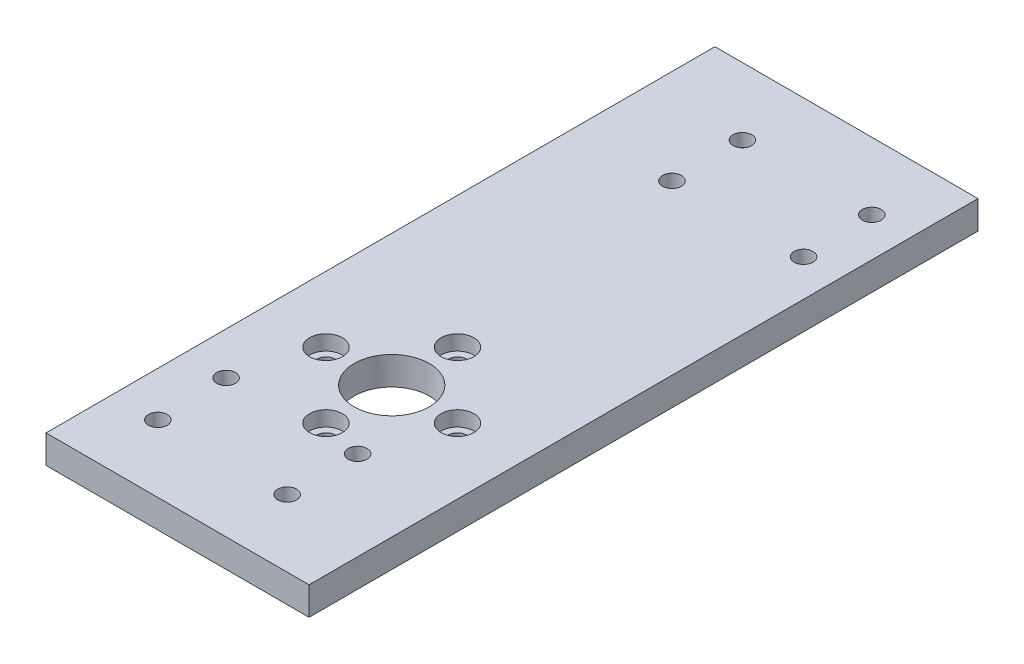
ISO-10303-21;
HEADER;
FILE_DESCRIPTION(('STEP AP214'),'2;1');
FILE_NAME('part.step','',(''),(''),'','','');
FILE_SCHEMA(('AUTOMOTIVE_DESIGN { 1 0 10303 214 1 1 1 1 }'));
ENDSEC;
DATA;
#1=APPLICATION_CONTEXT('core data for automotive mechanical design processes');
#2=APPLICATION_PROTOCOL_DEFINITION('international standard','automotive_design',2000,#1);
#3=PRODUCT_CONTEXT('',#1,'mechanical');
#4=PRODUCT('Part','Part','',(#3));
#5=PRODUCT_RELATED_PRODUCT_CATEGORY('part','',(#4));
#6=PRODUCT_DEFINITION_FORMATION('','',#4);
#7=PRODUCT_DEFINITION_CONTEXT('part definition',#1,'design');
#8=PRODUCT_DEFINITION('design','',#6,#7);
#9=PRODUCT_DEFINITION_SHAPE('','',#8);
#10=(LENGTH_UNIT() NAMED_UNIT(*) SI_UNIT(.MILLI.,.METRE.));
#11=(NAMED_UNIT(*) PLANE_ANGLE_UNIT() SI_UNIT($,.RADIAN.));
#12=(NAMED_UNIT(*) SI_UNIT($,.STERADIAN.) SOLID_ANGLE_UNIT());
#13=UNCERTAINTY_MEASURE_WITH_UNIT(LENGTH_MEASURE(1.E-05),#10,'distance_accuracy_value','');
#14=(GEOMETRIC_REPRESENTATION_CONTEXT(3) GLOBAL_UNCERTAINTY_ASSIGNED_CONTEXT((#13)) GLOBAL_UNIT_ASSIGNED_CONTEXT((#10,
#11,#12)) REPRESENTATION_CONTEXT('',''));
#15=CARTESIAN_POINT('',(0.,0.,0.));
#16=DIRECTION('',(0.,0.,1.));
#17=DIRECTION('',(1.,0.,0.));
#18=AXIS2_PLACEMENT_3D('',#15,#16,#17);
#19=CARTESIAN_POINT('',(-3.91877513505073,-7.,-28.4481628818932));
#20=DIRECTION('',(0.,1.,0.));
#21=DIRECTION('',(0.,0.,1.));
#22=AXIS2_PLACEMENT_3D('',#19,#20,#21);
#23=CYLINDRICAL_SURFACE('',#22,1.00000000000001);
#24=CARTESIAN_POINT('',(-3.91877513505073,3.,-28.4481628818932));
#25=DIRECTION('',(0.,1.,0.));
#26=DIRECTION('',(0.,0.,1.));
#27=AXIS2_PLACEMENT_3D('',#24,#25,#26);
#28=CIRCLE('',#27,1.00000000000001);
#29=CARTESIAN_POINT('',(-3.91877513505073,3.,-27.4481628818932));
#30=VERTEX_POINT('',#29);
#31=EDGE_CURVE('E242',#30,#30,#28,.T.);
#32=ORIENTED_EDGE('',*,*,#31,.T.);
#33=EDGE_LOOP('',(#32));
#34=FACE_BOUND('',#33,.T.);
#35=CARTESIAN_POINT('',(-3.91877513505073,1.6,-28.4481628818932));
#36=DIRECTION('',(0.,-1.,0.));
#37=DIRECTION('',(0.,0.,-1.));
#38=AXIS2_PLACEMENT_3D('',#35,#36,#37);
#39=CIRCLE('',#38,1.00000000000001);
#40=CARTESIAN_POINT('',(-3.91877513505073,1.6,-29.4481628818932));
#41=VERTEX_POINT('',#40);
#42=EDGE_CURVE('E41',#41,#41,#39,.F.);
#43=ORIENTED_EDGE('',*,*,#42,.F.);
#44=EDGE_LOOP('',(#43));
#45=FACE_BOUND('',#44,.T.);
#46=ADVANCED_FACE('F37',(#34,#45),#23,.F.);
#47=CARTESIAN_POINT('',(4.51877513505392,-7.,20.9481628818913));
#48=DIRECTION('',(0.,1.,0.));
#49=DIRECTION('',(0.,0.,1.));
#50=AXIS2_PLACEMENT_3D('',#47,#48,#49);
#51=CYLINDRICAL_SURFACE('',#50,1.00000000000002);
#52=CARTESIAN_POINT('',(4.51877513505392,3.,20.9481628818913));
#53=DIRECTION('',(0.,1.,0.));
#54=DIRECTION('',(0.,0.,1.));
#55=AXIS2_PLACEMENT_3D('',#52,#53,#54);
#56=CIRCLE('',#55,1.00000000000002);
#57=CARTESIAN_POINT('',(4.51877513505392,3.,21.9481628818913));
#58=VERTEX_POINT('',#57);
#59=EDGE_CURVE('E245',#58,#58,#56,.T.);
#60=ORIENTED_EDGE('',*,*,#59,.T.);
#61=EDGE_LOOP('',(#60));
#62=FACE_BOUND('',#61,.T.);
#63=CARTESIAN_POINT('',(4.51877513505392,1.6,20.9481628818913));
#64=DIRECTION('',(0.,-1.,0.));
#65=DIRECTION('',(0.,0.,-1.));
#66=AXIS2_PLACEMENT_3D('',#63,#64,#65);
#67=CIRCLE('',#66,1.00000000000002);
#68=CARTESIAN_POINT('',(4.51877513505392,1.6,19.9481628818913));
#69=VERTEX_POINT('',#68);
#70=EDGE_CURVE('E177',#69,#69,#67,.F.);
#71=ORIENTED_EDGE('',*,*,#70,.F.);
#72=EDGE_LOOP('',(#71));
#73=FACE_BOUND('',#72,.T.);
#74=ADVANCED_FACE('F278',(#62,#73),#51,.F.);
#75=CARTESIAN_POINT('',(4.51877513505393,-7.,28.4481628818913));
#76=DIRECTION('',(0.,1.,0.));
#77=DIRECTION('',(0.,0.,1.));
#78=AXIS2_PLACEMENT_3D('',#75,#76,#77);
#79=CYLINDRICAL_SURFACE('',#78,1.00000000000002);
#80=CARTESIAN_POINT('',(4.51877513505393,3.,28.4481628818913));
#81=DIRECTION('',(0.,1.,0.));
#82=DIRECTION('',(0.,0.,1.));
#83=AXIS2_PLACEMENT_3D('',#80,#81,#82);
#84=CIRCLE('',#83,1.00000000000002);
#85=CARTESIAN_POINT('',(4.51877513505393,3.,29.4481628818913));
#86=VERTEX_POINT('',#85);
#87=EDGE_CURVE('E248',#86,#86,#84,.T.);
#88=ORIENTED_EDGE('',*,*,#87,.T.);
#89=EDGE_LOOP('',(#88));
#90=FACE_BOUND('',#89,.T.);
#91=CARTESIAN_POINT('',(4.51877513505393,1.6,28.4481628818913));
#92=DIRECTION('',(0.,-1.,0.));
#93=DIRECTION('',(0.,0.,-1.));
#94=AXIS2_PLACEMENT_3D('',#91,#92,#93);
#95=CIRCLE('',#94,1.00000000000002);
#96=CARTESIAN_POINT('',(4.51877513505393,1.6,27.4481628818913));
#97=VERTEX_POINT('',#96);
#98=EDGE_CURVE('E173',#97,#97,#95,.F.);
#99=ORIENTED_EDGE('',*,*,#98,.F.);
#100=EDGE_LOOP('',(#99));
#101=FACE_BOUND('',#100,.T.);
#102=ADVANCED_FACE('F284',(#90,#101),#79,.F.);
#103=CARTESIAN_POINT('',(-9.48122486494609,-7.,20.9481628818913));
#104=DIRECTION('',(0.,1.,0.));
#105=DIRECTION('',(0.,0.,1.));
#106=AXIS2_PLACEMENT_3D('',#103,#104,#105);
#107=CYLINDRICAL_SURFACE('',#106,1.00000000000001);
#108=CARTESIAN_POINT('',(-9.48122486494609,3.,20.9481628818913));
#109=DIRECTION('',(0.,1.,0.));
#110=DIRECTION('',(0.,0.,1.));
#111=AXIS2_PLACEMENT_3D('',#108,#109,#110);
#112=CIRCLE('',#111,1.00000000000001);
#113=CARTESIAN_POINT('',(-9.48122486494609,3.,21.9481628818913));
#114=VERTEX_POINT('',#113);
#115=EDGE_CURVE('E254',#114,#114,#112,.T.);
#116=ORIENTED_EDGE('',*,*,#115,.T.);
#117=EDGE_LOOP('',(#116));
#118=FACE_BOUND('',#117,.T.);
#119=CARTESIAN_POINT('',(-9.48122486494609,1.6,20.9481628818913));
#120=DIRECTION('',(0.,-1.,0.));
#121=DIRECTION('',(0.,0.,-1.));
#122=AXIS2_PLACEMENT_3D('',#119,#120,#121);
#123=CIRCLE('',#122,1.00000000000001);
#124=CARTESIAN_POINT('',(-9.48122486494609,1.6,19.9481628818913));
#125=VERTEX_POINT('',#124);
#126=EDGE_CURVE('E168',#125,#125,#123,.F.);
#127=ORIENTED_EDGE('',*,*,#126,.F.);
#128=EDGE_LOOP('',(#127));
#129=FACE_BOUND('',#128,.T.);
#130=ADVANCED_FACE('F294',(#118,#129),#107,.F.);
#131=CARTESIAN_POINT('',(-9.24883244467996,-7.,28.4481628818913));
#132=DIRECTION('',(0.,1.,0.));
#133=DIRECTION('',(0.,0.,1.));
#134=AXIS2_PLACEMENT_3D('',#131,#132,#133);
#135=CYLINDRICAL_SURFACE('',#134,1.00000000000001);
#136=CARTESIAN_POINT('',(-9.24883244467996,3.,28.4481628818913));
#137=DIRECTION('',(0.,1.,0.));
#138=DIRECTION('',(0.,0.,1.));
#139=AXIS2_PLACEMENT_3D('',#136,#137,#138);
#140=CIRCLE('',#139,1.00000000000001);
#141=CARTESIAN_POINT('',(-9.24883244467996,3.,29.4481628818913));
#142=VERTEX_POINT('',#141);
#143=EDGE_CURVE('E251',#142,#142,#140,.T.);
#144=ORIENTED_EDGE('',*,*,#143,.T.);
#145=EDGE_LOOP('',(#144));
#146=FACE_BOUND('',#145,.T.);
#147=CARTESIAN_POINT('',(-9.24883244467996,1.6,28.4481628818913));
#148=DIRECTION('',(0.,-1.,0.));
#149=DIRECTION('',(0.,0.,-1.));
#150=AXIS2_PLACEMENT_3D('',#147,#148,#149);
#151=CIRCLE('',#150,1.00000000000001);
#152=CARTESIAN_POINT('',(-9.24883244467996,1.6,27.4481628818913));
#153=VERTEX_POINT('',#152);
#154=EDGE_CURVE('E163',#153,#153,#151,.F.);
#155=ORIENTED_EDGE('',*,*,#154,.F.);
#156=EDGE_LOOP('',(#155));
#157=FACE_BOUND('',#156,.T.);
#158=ADVANCED_FACE('F296',(#146,#157),#135,.F.);
#159=CARTESIAN_POINT('',(10.0812248649493,-7.,-20.9481628818932));
#160=DIRECTION('',(0.,1.,0.));
#161=DIRECTION('',(0.,0.,1.));
#162=AXIS2_PLACEMENT_3D('',#159,#160,#161);
#163=CYLINDRICAL_SURFACE('',#162,1.);
#164=CARTESIAN_POINT('',(10.0812248649493,3.,-20.9481628818932));
#165=DIRECTION('',(0.,1.,0.));
#166=DIRECTION('',(0.,0.,1.));
#167=AXIS2_PLACEMENT_3D('',#164,#165,#166);
#168=CIRCLE('',#167,1.);
#169=CARTESIAN_POINT('',(10.0812248649493,3.,-19.9481628818932));
#170=VERTEX_POINT('',#169);
#171=EDGE_CURVE('E236',#170,#170,#168,.T.);
#172=ORIENTED_EDGE('',*,*,#171,.T.);
#173=EDGE_LOOP('',(#172));
#174=FACE_BOUND('',#173,.T.);
#175=CARTESIAN_POINT('',(10.0812248649493,1.6,-20.9481628818932));
#176=DIRECTION('',(0.,-1.,0.));
#177=DIRECTION('',(0.,0.,-1.));
#178=AXIS2_PLACEMENT_3D('',#175,#176,#177);
#179=CIRCLE('',#178,1.);
#180=CARTESIAN_POINT('',(10.0812248649493,1.6,-21.9481628818932));
#181=VERTEX_POINT('',#180);
#182=EDGE_CURVE('E158',#181,#181,#179,.F.);
#183=ORIENTED_EDGE('',*,*,#182,.F.);
#184=EDGE_LOOP('',(#183));
#185=FACE_BOUND('',#184,.T.);
#186=ADVANCED_FACE('F299',(#174,#185),#163,.F.);
#187=CARTESIAN_POINT('',(9.84883244468316,-7.,-28.4481628818932));
#188=DIRECTION('',(0.,1.,0.));
#189=DIRECTION('',(0.,0.,1.));
#190=AXIS2_PLACEMENT_3D('',#187,#188,#189);
#191=CYLINDRICAL_SURFACE('',#190,1.00000000000001);
#192=CARTESIAN_POINT('',(9.84883244468316,3.,-28.4481628818932));
#193=DIRECTION('',(0.,1.,0.));
#194=DIRECTION('',(0.,0.,1.));
#195=AXIS2_PLACEMENT_3D('',#192,#193,#194);
#196=CIRCLE('',#195,1.00000000000001);
#197=CARTESIAN_POINT('',(9.84883244468316,3.,-27.4481628818932));
#198=VERTEX_POINT('',#197);
#199=EDGE_CURVE('E239',#198,#198,#196,.T.);
#200=ORIENTED_EDGE('',*,*,#199,.T.);
#201=EDGE_LOOP('',(#200));
#202=FACE_BOUND('',#201,.T.);
#203=CARTESIAN_POINT('',(9.84883244468316,1.6,-28.4481628818932));
#204=DIRECTION('',(0.,-1.,0.));
#205=DIRECTION('',(0.,0.,-1.));
#206=AXIS2_PLACEMENT_3D('',#203,#204,#205);
#207=CIRCLE('',#206,1.00000000000001);
#208=CARTESIAN_POINT('',(9.84883244468316,1.6,-29.4481628818932));
#209=VERTEX_POINT('',#208);
#210=EDGE_CURVE('E153',#209,#209,#207,.F.);
#211=ORIENTED_EDGE('',*,*,#210,.F.);
#212=EDGE_LOOP('',(#211));
#213=FACE_BOUND('',#212,.T.);
#214=ADVANCED_FACE('F289',(#202,#213),#191,.F.);
#215=CARTESIAN_POINT('',(-3.91877513505072,-7.,-20.9481628818932));
#216=DIRECTION('',(0.,1.,0.));
#217=DIRECTION('',(0.,0.,1.));
#218=AXIS2_PLACEMENT_3D('',#215,#216,#217);
#219=CYLINDRICAL_SURFACE('',#218,1.00000000000001);
#220=CARTESIAN_POINT('',(-3.91877513505072,3.,-20.9481628818932));
#221=DIRECTION('',(0.,1.,0.));
#222=DIRECTION('',(0.,0.,1.));
#223=AXIS2_PLACEMENT_3D('',#220,#221,#222);
#224=CIRCLE('',#223,1.00000000000001);
#225=CARTESIAN_POINT('',(-3.91877513505072,3.,-19.9481628818932));
#226=VERTEX_POINT('',#225);
#227=EDGE_CURVE('E131',#226,#226,#224,.T.);
#228=ORIENTED_EDGE('',*,*,#227,.T.);
#229=EDGE_LOOP('',(#228));
#230=FACE_BOUND('',#229,.T.);
#231=CARTESIAN_POINT('',(-3.91877513505072,1.6,-20.9481628818932));
#232=DIRECTION('',(0.,-1.,0.));
#233=DIRECTION('',(0.,0.,-1.));
#234=AXIS2_PLACEMENT_3D('',#231,#232,#233);
#235=CIRCLE('',#234,1.00000000000001);
#236=CARTESIAN_POINT('',(-3.91877513505072,1.6,-21.9481628818932));
#237=VERTEX_POINT('',#236);
#238=EDGE_CURVE('E148',#237,#237,#235,.F.);
#239=ORIENTED_EDGE('',*,*,#238,.F.);
#240=EDGE_LOOP('',(#239));
#241=FACE_BOUND('',#240,.T.);
#242=ADVANCED_FACE('F319',(#230,#241),#219,.F.);
#243=CARTESIAN_POINT('',(7.0000000000001,-7.,12.7999999999978));
#244=DIRECTION('',(0.,1.,0.));
#245=DIRECTION('',(0.,0.,1.));
#246=AXIS2_PLACEMENT_3D('',#243,#244,#245);
#247=CYLINDRICAL_SURFACE('',#246,1.);
#248=CARTESIAN_POINT('',(7.0000000000001,0.,12.7999999999978));
#249=DIRECTION('',(0.,-1.,0.));
#250=DIRECTION('',(0.,0.,-1.));
#251=AXIS2_PLACEMENT_3D('',#248,#249,#250);
#252=CIRCLE('',#251,1.);
#253=CARTESIAN_POINT('',(7.0000000000001,0.,11.7999999999978));
#254=VERTEX_POINT('',#253);
#255=EDGE_CURVE('E115',#254,#254,#252,.T.);
#256=ORIENTED_EDGE('',*,*,#255,.T.);
#257=EDGE_LOOP('',(#256));
#258=FACE_BOUND('',#257,.T.);
#259=CARTESIAN_POINT('',(7.0000000000001,1.4,12.7999999999978));
#260=DIRECTION('',(0.,1.,0.));
#261=DIRECTION('',(0.,0.,1.));
#262=AXIS2_PLACEMENT_3D('',#259,#260,#261);
#263=CIRCLE('',#262,1.);
#264=CARTESIAN_POINT('',(7.0000000000001,1.4,13.7999999999978));
#265=VERTEX_POINT('',#264);
#266=EDGE_CURVE('E143',#265,#265,#263,.F.);
#267=ORIENTED_EDGE('',*,*,#266,.F.);
#268=EDGE_LOOP('',(#267));
#269=FACE_BOUND('',#268,.T.);
#270=ADVANCED_FACE('F312',(#258,#269),#247,.F.);
#271=CARTESIAN_POINT('',(-6.9999999999999,-7.,12.7999999999979));
#272=DIRECTION('',(0.,1.,0.));
#273=DIRECTION('',(0.,0.,1.));
#274=AXIS2_PLACEMENT_3D('',#271,#272,#273);
#275=CYLINDRICAL_SURFACE('',#274,1.);
#276=CARTESIAN_POINT('',(-6.9999999999999,0.,12.7999999999979));
#277=DIRECTION('',(0.,-1.,0.));
#278=DIRECTION('',(0.,0.,-1.));
#279=AXIS2_PLACEMENT_3D('',#276,#277,#278);
#280=CIRCLE('',#279,1.);
#281=CARTESIAN_POINT('',(-6.9999999999999,0.,11.7999999999979));
#282=VERTEX_POINT('',#281);
#283=EDGE_CURVE('E121',#282,#282,#280,.T.);
#284=ORIENTED_EDGE('',*,*,#283,.T.);
#285=EDGE_LOOP('',(#284));
#286=FACE_BOUND('',#285,.T.);
#287=CARTESIAN_POINT('',(-6.9999999999999,1.4,12.7999999999979));
#288=DIRECTION('',(0.,1.,0.));
#289=DIRECTION('',(0.,0.,1.));
#290=AXIS2_PLACEMENT_3D('',#287,#288,#289);
#291=CIRCLE('',#290,1.);
#292=CARTESIAN_POINT('',(-6.9999999999999,1.4,13.7999999999979));
#293=VERTEX_POINT('',#292);
#294=EDGE_CURVE('E138',#293,#293,#291,.F.);
#295=ORIENTED_EDGE('',*,*,#294,.F.);
#296=EDGE_LOOP('',(#295));
#297=FACE_BOUND('',#296,.T.);
#298=ADVANCED_FACE('F308',(#286,#297),#275,.F.);
#299=CARTESIAN_POINT('',(0.,-7.,5.79999999999792));
#300=DIRECTION('',(0.,1.,0.));
#301=DIRECTION('',(0.,0.,1.));
#302=AXIS2_PLACEMENT_3D('',#299,#300,#301);
#303=CYLINDRICAL_SURFACE('',#302,1.);
#304=CARTESIAN_POINT('',(0.,0.,5.79999999999792));
#305=DIRECTION('',(0.,-1.,0.));
#306=DIRECTION('',(0.,0.,-1.));
#307=AXIS2_PLACEMENT_3D('',#304,#305,#306);
#308=CIRCLE('',#307,1.);
#309=CARTESIAN_POINT('',(0.,0.,4.79999999999792));
#310=VERTEX_POINT('',#309);
#311=EDGE_CURVE('E107',#310,#310,#308,.T.);
#312=ORIENTED_EDGE('',*,*,#311,.T.);
#313=EDGE_LOOP('',(#312));
#314=FACE_BOUND('',#313,.T.);
#315=CARTESIAN_POINT('',(0.,1.4,5.79999999999792));
#316=DIRECTION('',(0.,1.,0.));
#317=DIRECTION('',(0.,0.,1.));
#318=AXIS2_PLACEMENT_3D('',#315,#316,#317);
#319=CIRCLE('',#318,1.);
#320=CARTESIAN_POINT('',(0.,1.4,6.79999999999792));
#321=VERTEX_POINT('',#320);
#322=EDGE_CURVE('E133',#321,#321,#319,.F.);
#323=ORIENTED_EDGE('',*,*,#322,.F.);
#324=EDGE_LOOP('',(#323));
#325=FACE_BOUND('',#324,.T.);
#326=ADVANCED_FACE('F311',(#314,#325),#303,.F.);
#327=CARTESIAN_POINT('',(1.45764745514838E-13,-7.,19.7999999999979));
#328=DIRECTION('',(0.,1.,0.));
#329=DIRECTION('',(0.,0.,1.));
#330=AXIS2_PLACEMENT_3D('',#327,#328,#329);
#331=CYLINDRICAL_SURFACE('',#330,1.);
#332=CARTESIAN_POINT('',(1.45764745514838E-13,0.,19.7999999999979));
#333=DIRECTION('',(0.,-1.,0.));
#334=DIRECTION('',(0.,0.,-1.));
#335=AXIS2_PLACEMENT_3D('',#332,#333,#334);
#336=CIRCLE('',#335,1.);
#337=CARTESIAN_POINT('',(1.45764745514838E-13,0.,18.7999999999979));
#338=VERTEX_POINT('',#337);
#339=EDGE_CURVE('E118',#338,#338,#336,.T.);
#340=ORIENTED_EDGE('',*,*,#339,.T.);
#341=EDGE_LOOP('',(#340));
#342=FACE_BOUND('',#341,.T.);
#343=CARTESIAN_POINT('',(1.45764745514838E-13,1.4,19.7999999999979));
#344=DIRECTION('',(0.,1.,0.));
#345=DIRECTION('',(0.,0.,1.));
#346=AXIS2_PLACEMENT_3D('',#343,#344,#345);
#347=CIRCLE('',#346,1.);
#348=CARTESIAN_POINT('',(1.45764745514838E-13,1.4,20.7999999999979));
#349=VERTEX_POINT('',#348);
#350=EDGE_CURVE('E128',#349,#349,#347,.F.);
#351=ORIENTED_EDGE('',*,*,#350,.F.);
#352=EDGE_LOOP('',(#351));
#353=FACE_BOUND('',#352,.T.);
#354=ADVANCED_FACE('F314',(#342,#353),#331,.F.);
#355=CARTESIAN_POINT('',(14.,3.,35.6));
#356=DIRECTION('',(-1.,0.,0.));
#357=DIRECTION('',(0.,0.,1.));
#358=AXIS2_PLACEMENT_3D('',#355,#356,#357);
#359=PLANE('',#358);
#360=DIRECTION('',(0.,0.,-1.));
#361=VECTOR('',#360,1.);
#362=CARTESIAN_POINT('',(14.,0.,35.6));
#363=LINE('',#362,#361);
#364=CARTESIAN_POINT('',(14.,0.,35.6));
#365=VERTEX_POINT('',#364);
#366=CARTESIAN_POINT('',(14.,0.,-35.6));
#367=VERTEX_POINT('',#366);
#368=EDGE_CURVE('E104',#365,#367,#363,.T.);
#369=ORIENTED_EDGE('',*,*,#368,.T.);
#370=DIRECTION('',(0.,-1.,0.));
#371=VECTOR('',#370,1.);
#372=CARTESIAN_POINT('',(14.,3.,-35.6));
#373=LINE('',#372,#371);
#374=CARTESIAN_POINT('',(14.,3.,-35.6));
#375=VERTEX_POINT('',#374);
#376=EDGE_CURVE('E11',#375,#367,#373,.T.);
#377=ORIENTED_EDGE('',*,*,#376,.F.);
#378=DIRECTION('',(0.,0.,-1.));
#379=VECTOR('',#378,1.);
#380=CARTESIAN_POINT('',(14.,3.,35.6));
#381=LINE('',#380,#379);
#382=CARTESIAN_POINT('',(14.,3.,35.6));
#383=VERTEX_POINT('',#382);
#384=EDGE_CURVE('E91',#383,#375,#381,.T.);
#385=ORIENTED_EDGE('',*,*,#384,.F.);
#386=DIRECTION('',(0.,-1.,0.));
#387=VECTOR('',#386,1.);
#388=CARTESIAN_POINT('',(14.,3.,35.6));
#389=LINE('',#388,#387);
#390=EDGE_CURVE('E100',#383,#365,#389,.T.);
#391=ORIENTED_EDGE('',*,*,#390,.T.);
#392=EDGE_LOOP('',(#369,#377,#385,#391));
#393=FACE_BOUND('',#392,.T.);
#394=ADVANCED_FACE('F39',(#393),#359,.F.);
#395=CARTESIAN_POINT('',(-14.,3.,-35.6));
#396=DIRECTION('',(0.,0.,1.));
#397=DIRECTION('',(1.,0.,0.));
#398=AXIS2_PLACEMENT_3D('',#395,#396,#397);
#399=PLANE('',#398);
#400=DIRECTION('',(-1.,0.,0.));
#401=VECTOR('',#400,1.);
#402=CARTESIAN_POINT('',(-14.,0.,-35.6));
#403=LINE('',#402,#401);
#404=CARTESIAN_POINT('',(-14.,0.,-35.6));
#405=VERTEX_POINT('',#404);
#406=EDGE_CURVE('E95',#367,#405,#403,.T.);
#407=ORIENTED_EDGE('',*,*,#406,.T.);
#408=DIRECTION('',(0.,-1.,0.));
#409=VECTOR('',#408,1.);
#410=CARTESIAN_POINT('',(-14.,3.,-35.6));
#411=LINE('',#410,#409);
#412=CARTESIAN_POINT('',(-14.,3.,-35.6));
#413=VERTEX_POINT('',#412);
#414=EDGE_CURVE('E47',#413,#405,#411,.T.);
#415=ORIENTED_EDGE('',*,*,#414,.F.);
#416=DIRECTION('',(-1.,0.,0.));
#417=VECTOR('',#416,1.);
#418=CARTESIAN_POINT('',(-14.,3.,-35.6));
#419=LINE('',#418,#417);
#420=EDGE_CURVE('E86',#375,#413,#419,.T.);
#421=ORIENTED_EDGE('',*,*,#420,.F.);
#422=ORIENTED_EDGE('',*,*,#376,.T.);
#423=EDGE_LOOP('',(#407,#415,#421,#422));
#424=FACE_BOUND('',#423,.T.);
#425=ADVANCED_FACE('F94',(#424),#399,.F.);
#426=CARTESIAN_POINT('',(-14.,3.,35.6));
#427=DIRECTION('',(1.,0.,0.));
#428=DIRECTION('',(0.,0.,-1.));
#429=AXIS2_PLACEMENT_3D('',#426,#427,#428);
#430=PLANE('',#429);
#431=DIRECTION('',(0.,0.,1.));
#432=VECTOR('',#431,1.);
#433=CARTESIAN_POINT('',(-14.,0.,35.6));
#434=LINE('',#433,#432);
#435=CARTESIAN_POINT('',(-14.,0.,35.6));
#436=VERTEX_POINT('',#435);
#437=EDGE_CURVE('E73',#405,#436,#434,.T.);
#438=ORIENTED_EDGE('',*,*,#437,.T.);
#439=DIRECTION('',(0.,-1.,0.));
#440=VECTOR('',#439,1.);
#441=CARTESIAN_POINT('',(-14.,3.,35.6));
#442=LINE('',#441,#440);
#443=CARTESIAN_POINT('',(-14.,3.,35.6));
#444=VERTEX_POINT('',#443);
#445=EDGE_CURVE('E96',#444,#436,#442,.T.);
#446=ORIENTED_EDGE('',*,*,#445,.F.);
#447=DIRECTION('',(0.,0.,1.));
#448=VECTOR('',#447,1.);
#449=CARTESIAN_POINT('',(-14.,3.,35.6));
#450=LINE('',#449,#448);
#451=EDGE_CURVE('E89',#413,#444,#450,.T.);
#452=ORIENTED_EDGE('',*,*,#451,.F.);
#453=ORIENTED_EDGE('',*,*,#414,.T.);
#454=EDGE_LOOP('',(#438,#446,#452,#453));
#455=FACE_BOUND('',#454,.T.);
#456=ADVANCED_FACE('F98',(#455),#430,.F.);
#457=CARTESIAN_POINT('',(-14.,3.,35.6));
#458=DIRECTION('',(0.,0.,-1.));
#459=DIRECTION('',(-1.,0.,0.));
#460=AXIS2_PLACEMENT_3D('',#457,#458,#459);
#461=PLANE('',#460);
#462=DIRECTION('',(1.,0.,0.));
#463=VECTOR('',#462,1.);
#464=CARTESIAN_POINT('',(-14.,0.,35.6));
#465=LINE('',#464,#463);
#466=EDGE_CURVE('E79',#436,#365,#465,.T.);
#467=ORIENTED_EDGE('',*,*,#466,.T.);
#468=ORIENTED_EDGE('',*,*,#390,.F.);
#469=DIRECTION('',(1.,0.,0.));
#470=VECTOR('',#469,1.);
#471=CARTESIAN_POINT('',(-14.,3.,35.6));
#472=LINE('',#471,#470);
#473=EDGE_CURVE('E56',#444,#383,#472,.T.);
#474=ORIENTED_EDGE('',*,*,#473,.F.);
#475=ORIENTED_EDGE('',*,*,#445,.T.);
#476=EDGE_LOOP('',(#467,#468,#474,#475));
#477=FACE_BOUND('',#476,.T.);
#478=ADVANCED_FACE('F264',(#477),#461,.F.);
#479=CARTESIAN_POINT('',(0.,3.,0.));
#480=DIRECTION('',(0.,-1.,0.));
#481=DIRECTION('',(0.,0.,-1.));
#482=AXIS2_PLACEMENT_3D('',#479,#480,#481);
#483=PLANE('',#482);
#484=CARTESIAN_POINT('',(7.0000000000001,3.,12.7999999999978));
#485=DIRECTION('',(0.,1.,0.));
#486=DIRECTION('',(0.,0.,1.));
#487=AXIS2_PLACEMENT_3D('',#484,#485,#486);
#488=CIRCLE('',#487,1.75);
#489=CARTESIAN_POINT('',(7.0000000000001,3.,14.5499999999978));
#490=VERTEX_POINT('',#489);
#491=EDGE_CURVE('E151',#490,#490,#488,.T.);
#492=ORIENTED_EDGE('',*,*,#491,.F.);
#493=EDGE_LOOP('',(#492));
#494=FACE_BOUND('',#493,.T.);
#495=CARTESIAN_POINT('',(-6.9999999999999,3.,12.7999999999979));
#496=DIRECTION('',(0.,1.,0.));
#497=DIRECTION('',(0.,0.,1.));
#498=AXIS2_PLACEMENT_3D('',#495,#496,#497);
#499=CIRCLE('',#498,1.75);
#500=CARTESIAN_POINT('',(-6.9999999999999,3.,14.5499999999979));
#501=VERTEX_POINT('',#500);
#502=EDGE_CURVE('E146',#501,#501,#499,.T.);
#503=ORIENTED_EDGE('',*,*,#502,.F.);
#504=EDGE_LOOP('',(#503));
#505=FACE_BOUND('',#504,.T.);
#506=CARTESIAN_POINT('',(0.,3.,5.79999999999792));
#507=DIRECTION('',(0.,1.,0.));
#508=DIRECTION('',(0.,0.,1.));
#509=AXIS2_PLACEMENT_3D('',#506,#507,#508);
#510=CIRCLE('',#509,1.75);
#511=CARTESIAN_POINT('',(0.,3.,7.54999999999792));
#512=VERTEX_POINT('',#511);
#513=EDGE_CURVE('E141',#512,#512,#510,.T.);
#514=ORIENTED_EDGE('',*,*,#513,.F.);
#515=EDGE_LOOP('',(#514));
#516=FACE_BOUND('',#515,.T.);
#517=CARTESIAN_POINT('',(1.45764745514838E-13,3.,19.7999999999979));
#518=DIRECTION('',(0.,1.,0.));
#519=DIRECTION('',(0.,0.,1.));
#520=AXIS2_PLACEMENT_3D('',#517,#518,#519);
#521=CIRCLE('',#520,1.75);
#522=CARTESIAN_POINT('',(1.45764745514838E-13,3.,21.5499999999979));
#523=VERTEX_POINT('',#522);
#524=EDGE_CURVE('E136',#523,#523,#521,.T.);
#525=ORIENTED_EDGE('',*,*,#524,.F.);
#526=EDGE_LOOP('',(#525));
#527=FACE_BOUND('',#526,.T.);
#528=ORIENTED_EDGE('',*,*,#227,.F.);
#529=EDGE_LOOP('',(#528));
#530=FACE_BOUND('',#529,.T.);
#531=ORIENTED_EDGE('',*,*,#171,.F.);
#532=EDGE_LOOP('',(#531));
#533=FACE_BOUND('',#532,.T.);
#534=ORIENTED_EDGE('',*,*,#199,.F.);
#535=EDGE_LOOP('',(#534));
#536=FACE_BOUND('',#535,.T.);
#537=ORIENTED_EDGE('',*,*,#31,.F.);
#538=EDGE_LOOP('',(#537));
#539=FACE_BOUND('',#538,.T.);
#540=ORIENTED_EDGE('',*,*,#59,.F.);
#541=EDGE_LOOP('',(#540));
#542=FACE_BOUND('',#541,.T.);
#543=ORIENTED_EDGE('',*,*,#87,.F.);
#544=EDGE_LOOP('',(#543));
#545=FACE_BOUND('',#544,.T.);
#546=ORIENTED_EDGE('',*,*,#143,.F.);
#547=EDGE_LOOP('',(#546));
#548=FACE_BOUND('',#547,.T.);
#549=ORIENTED_EDGE('',*,*,#115,.F.);
#550=EDGE_LOOP('',(#549));
#551=FACE_BOUND('',#550,.T.);
#552=CARTESIAN_POINT('',(0.,3.,12.7999999999985));
#553=DIRECTION('',(0.,1.,0.));
#554=DIRECTION('',(0.,0.,1.));
#555=AXIS2_PLACEMENT_3D('',#552,#553,#554);
#556=CIRCLE('',#555,4.);
#557=CARTESIAN_POINT('',(0.,3.,16.7999999999985));
#558=VERTEX_POINT('',#557);
#559=EDGE_CURVE('E127',#558,#558,#556,.T.);
#560=ORIENTED_EDGE('',*,*,#559,.F.);
#561=EDGE_LOOP('',(#560));
#562=FACE_BOUND('',#561,.T.);
#563=ORIENTED_EDGE('',*,*,#384,.T.);
#564=ORIENTED_EDGE('',*,*,#420,.T.);
#565=ORIENTED_EDGE('',*,*,#451,.T.);
#566=ORIENTED_EDGE('',*,*,#473,.T.);
#567=EDGE_LOOP('',(#563,#564,#565,#566));
#568=FACE_BOUND('',#567,.T.);
#569=ADVANCED_FACE('F87',(#494,#505,#516,#527,#530,#533,#536,#539,#542,#545,#548,#551,#562,
#568),#483,.F.);
#570=CARTESIAN_POINT('',(0.,0.,0.));
#571=DIRECTION('',(0.,-1.,0.));
#572=DIRECTION('',(0.,0.,-1.));
#573=AXIS2_PLACEMENT_3D('',#570,#571,#572);
#574=PLANE('',#573);
#575=CARTESIAN_POINT('',(-3.91877513505052,0.,-28.4481628818932));
#576=DIRECTION('',(0.,-1.,0.));
#577=DIRECTION('',(0.,0.,-1.));
#578=AXIS2_PLACEMENT_3D('',#575,#576,#577);
#579=CIRCLE('',#578,1.75);
#580=CARTESIAN_POINT('',(-3.91877513505052,0.,-30.1981628818932));
#581=VERTEX_POINT('',#580);
#582=EDGE_CURVE('E193',#581,#581,#579,.T.);
#583=ORIENTED_EDGE('',*,*,#582,.F.);
#584=EDGE_LOOP('',(#583));
#585=FACE_BOUND('',#584,.T.);
#586=CARTESIAN_POINT('',(4.51877513505412,0.,20.9481628818913));
#587=DIRECTION('',(0.,-1.,0.));
#588=DIRECTION('',(0.,0.,-1.));
#589=AXIS2_PLACEMENT_3D('',#586,#587,#588);
#590=CIRCLE('',#589,1.74999999999999);
#591=CARTESIAN_POINT('',(4.51877513505412,0.,19.1981628818913));
#592=VERTEX_POINT('',#591);
#593=EDGE_CURVE('E186',#592,#592,#590,.T.);
#594=ORIENTED_EDGE('',*,*,#593,.F.);
#595=EDGE_LOOP('',(#594));
#596=FACE_BOUND('',#595,.T.);
#597=CARTESIAN_POINT('',(4.51877513505413,0.,28.4481628818913));
#598=DIRECTION('',(0.,-1.,0.));
#599=DIRECTION('',(0.,0.,-1.));
#600=AXIS2_PLACEMENT_3D('',#597,#598,#599);
#601=CIRCLE('',#600,1.74999999999999);
#602=CARTESIAN_POINT('',(4.51877513505413,0.,26.6981628818913));
#603=VERTEX_POINT('',#602);
#604=EDGE_CURVE('E179',#603,#603,#601,.T.);
#605=ORIENTED_EDGE('',*,*,#604,.F.);
#606=EDGE_LOOP('',(#605));
#607=FACE_BOUND('',#606,.T.);
#608=CARTESIAN_POINT('',(-9.48122486494588,0.,20.9481628818913));
#609=DIRECTION('',(0.,-1.,0.));
#610=DIRECTION('',(0.,0.,-1.));
#611=AXIS2_PLACEMENT_3D('',#608,#609,#610);
#612=CIRCLE('',#611,1.75000000000001);
#613=CARTESIAN_POINT('',(-9.48122486494588,0.,19.1981628818913));
#614=VERTEX_POINT('',#613);
#615=EDGE_CURVE('E175',#614,#614,#612,.T.);
#616=ORIENTED_EDGE('',*,*,#615,.F.);
#617=EDGE_LOOP('',(#616));
#618=FACE_BOUND('',#617,.T.);
#619=CARTESIAN_POINT('',(-9.24883244467975,0.,28.4481628818914));
#620=DIRECTION('',(0.,-1.,0.));
#621=DIRECTION('',(0.,0.,-1.));
#622=AXIS2_PLACEMENT_3D('',#619,#620,#621);
#623=CIRCLE('',#622,1.75000000000001);
#624=CARTESIAN_POINT('',(-9.24883244467975,0.,26.6981628818913));
#625=VERTEX_POINT('',#624);
#626=EDGE_CURVE('E171',#625,#625,#623,.T.);
#627=ORIENTED_EDGE('',*,*,#626,.F.);
#628=EDGE_LOOP('',(#627));
#629=FACE_BOUND('',#628,.T.);
#630=CARTESIAN_POINT('',(10.0812248649495,0.,-20.9481628818932));
#631=DIRECTION('',(0.,-1.,0.));
#632=DIRECTION('',(0.,0.,-1.));
#633=AXIS2_PLACEMENT_3D('',#630,#631,#632);
#634=CIRCLE('',#633,1.75);
#635=CARTESIAN_POINT('',(10.0812248649495,0.,-22.6981628818932));
#636=VERTEX_POINT('',#635);
#637=EDGE_CURVE('E166',#636,#636,#634,.T.);
#638=ORIENTED_EDGE('',*,*,#637,.F.);
#639=EDGE_LOOP('',(#638));
#640=FACE_BOUND('',#639,.T.);
#641=CARTESIAN_POINT('',(9.84883244468337,0.,-28.4481628818932));
#642=DIRECTION('',(0.,-1.,0.));
#643=DIRECTION('',(0.,0.,-1.));
#644=AXIS2_PLACEMENT_3D('',#641,#642,#643);
#645=CIRCLE('',#644,1.75);
#646=CARTESIAN_POINT('',(9.84883244468337,0.,-30.1981628818932));
#647=VERTEX_POINT('',#646);
#648=EDGE_CURVE('E161',#647,#647,#645,.T.);
#649=ORIENTED_EDGE('',*,*,#648,.F.);
#650=EDGE_LOOP('',(#649));
#651=FACE_BOUND('',#650,.T.);
#652=CARTESIAN_POINT('',(-3.91877513505052,0.,-20.9481628818932));
#653=DIRECTION('',(0.,-1.,0.));
#654=DIRECTION('',(0.,0.,-1.));
#655=AXIS2_PLACEMENT_3D('',#652,#653,#654);
#656=CIRCLE('',#655,1.75000000000001);
#657=CARTESIAN_POINT('',(-3.91877513505052,0.,-22.6981628818932));
#658=VERTEX_POINT('',#657);
#659=EDGE_CURVE('E156',#658,#658,#656,.T.);
#660=ORIENTED_EDGE('',*,*,#659,.F.);
#661=EDGE_LOOP('',(#660));
#662=FACE_BOUND('',#661,.T.);
#663=CARTESIAN_POINT('',(0.,0.,12.7999999999985));
#664=DIRECTION('',(0.,-1.,0.));
#665=DIRECTION('',(0.,0.,-1.));
#666=AXIS2_PLACEMENT_3D('',#663,#664,#665);
#667=CIRCLE('',#666,4.);
#668=CARTESIAN_POINT('',(0.,0.,8.79999999999852));
#669=VERTEX_POINT('',#668);
#670=EDGE_CURVE('E124',#669,#669,#667,.T.);
#671=ORIENTED_EDGE('',*,*,#670,.F.);
#672=EDGE_LOOP('',(#671));
#673=FACE_BOUND('',#672,.T.);
#674=ORIENTED_EDGE('',*,*,#283,.F.);
#675=EDGE_LOOP('',(#674));
#676=FACE_BOUND('',#675,.T.);
#677=ORIENTED_EDGE('',*,*,#339,.F.);
#678=EDGE_LOOP('',(#677));
#679=FACE_BOUND('',#678,.T.);
#680=ORIENTED_EDGE('',*,*,#255,.F.);
#681=EDGE_LOOP('',(#680));
#682=FACE_BOUND('',#681,.T.);
#683=ORIENTED_EDGE('',*,*,#311,.F.);
#684=EDGE_LOOP('',(#683));
#685=FACE_BOUND('',#684,.T.);
#686=ORIENTED_EDGE('',*,*,#368,.F.);
#687=ORIENTED_EDGE('',*,*,#466,.F.);
#688=ORIENTED_EDGE('',*,*,#437,.F.);
#689=ORIENTED_EDGE('',*,*,#406,.F.);
#690=EDGE_LOOP('',(#686,#687,#688,#689));
#691=FACE_BOUND('',#690,.T.);
#692=ADVANCED_FACE('F263',(#585,#596,#607,#618,#629,#640,#651,#662,#673,#676,#679,#682,#685,
#691),#574,.T.);
#693=CARTESIAN_POINT('',(0.,-7.,12.7999999999985));
#694=DIRECTION('',(0.,1.,0.));
#695=DIRECTION('',(0.,0.,1.));
#696=AXIS2_PLACEMENT_3D('',#693,#694,#695);
#697=CYLINDRICAL_SURFACE('',#696,4.);
#698=ORIENTED_EDGE('',*,*,#670,.T.);
#699=EDGE_LOOP('',(#698));
#700=FACE_BOUND('',#699,.T.);
#701=ORIENTED_EDGE('',*,*,#559,.T.);
#702=EDGE_LOOP('',(#701));
#703=FACE_BOUND('',#702,.T.);
#704=ADVANCED_FACE('F260',(#700,#703),#697,.F.);
#705=CARTESIAN_POINT('',(1.45764745514838E-13,1.4,19.7999999999979));
#706=DIRECTION('',(0.,1.,0.));
#707=DIRECTION('',(0.,0.,1.));
#708=AXIS2_PLACEMENT_3D('',#705,#706,#707);
#709=PLANE('',#708);
#710=CARTESIAN_POINT('',(1.45764745514838E-13,1.4,19.7999999999979));
#711=DIRECTION('',(0.,1.,0.));
#712=DIRECTION('',(0.,0.,1.));
#713=AXIS2_PLACEMENT_3D('',#710,#711,#712);
#714=CIRCLE('',#713,1.75);
#715=CARTESIAN_POINT('',(1.45764745514838E-13,1.4,21.5499999999979));
#716=VERTEX_POINT('',#715);
#717=EDGE_CURVE('E132',#716,#716,#714,.T.);
#718=ORIENTED_EDGE('',*,*,#717,.T.);
#719=EDGE_LOOP('',(#718));
#720=FACE_BOUND('',#719,.T.);
#721=ORIENTED_EDGE('',*,*,#350,.T.);
#722=EDGE_LOOP('',(#721));
#723=FACE_BOUND('',#722,.T.);
#724=ADVANCED_FACE('F306',(#720,#723),#709,.T.);
#725=CARTESIAN_POINT('',(1.45764745514838E-13,1.4,19.7999999999979));
#726=DIRECTION('',(0.,1.,0.));
#727=DIRECTION('',(0.,0.,1.));
#728=AXIS2_PLACEMENT_3D('',#725,#726,#727);
#729=CYLINDRICAL_SURFACE('',#728,1.75);
#730=ORIENTED_EDGE('',*,*,#717,.F.);
#731=EDGE_LOOP('',(#730));
#732=FACE_BOUND('',#731,.T.);
#733=ORIENTED_EDGE('',*,*,#524,.T.);
#734=EDGE_LOOP('',(#733));
#735=FACE_BOUND('',#734,.T.);
#736=ADVANCED_FACE('F332',(#732,#735),#729,.F.);
#737=CARTESIAN_POINT('',(0.,1.4,5.79999999999792));
#738=DIRECTION('',(0.,1.,0.));
#739=DIRECTION('',(0.,0.,1.));
#740=AXIS2_PLACEMENT_3D('',#737,#738,#739);
#741=PLANE('',#740);
#742=CARTESIAN_POINT('',(0.,1.4,5.79999999999792));
#743=DIRECTION('',(0.,1.,0.));
#744=DIRECTION('',(0.,0.,1.));
#745=AXIS2_PLACEMENT_3D('',#742,#743,#744);
#746=CIRCLE('',#745,1.75);
#747=CARTESIAN_POINT('',(0.,1.4,7.54999999999792));
#748=VERTEX_POINT('',#747);
#749=EDGE_CURVE('E137',#748,#748,#746,.T.);
#750=ORIENTED_EDGE('',*,*,#749,.T.);
#751=EDGE_LOOP('',(#750));
#752=FACE_BOUND('',#751,.T.);
#753=ORIENTED_EDGE('',*,*,#322,.T.);
#754=EDGE_LOOP('',(#753));
#755=FACE_BOUND('',#754,.T.);
#756=ADVANCED_FACE('F329',(#752,#755),#741,.T.);
#757=CARTESIAN_POINT('',(0.,1.4,5.79999999999792));
#758=DIRECTION('',(0.,1.,0.));
#759=DIRECTION('',(0.,0.,1.));
#760=AXIS2_PLACEMENT_3D('',#757,#758,#759);
#761=CYLINDRICAL_SURFACE('',#760,1.75);
#762=ORIENTED_EDGE('',*,*,#749,.F.);
#763=EDGE_LOOP('',(#762));
#764=FACE_BOUND('',#763,.T.);
#765=ORIENTED_EDGE('',*,*,#513,.T.);
#766=EDGE_LOOP('',(#765));
#767=FACE_BOUND('',#766,.T.);
#768=ADVANCED_FACE('F331',(#764,#767),#761,.F.);
#769=CARTESIAN_POINT('',(-6.9999999999999,1.4,12.7999999999979));
#770=DIRECTION('',(0.,1.,0.));
#771=DIRECTION('',(0.,0.,1.));
#772=AXIS2_PLACEMENT_3D('',#769,#770,#771);
#773=PLANE('',#772);
#774=CARTESIAN_POINT('',(-6.9999999999999,1.4,12.7999999999979));
#775=DIRECTION('',(0.,1.,0.));
#776=DIRECTION('',(0.,0.,1.));
#777=AXIS2_PLACEMENT_3D('',#774,#775,#776);
#778=CIRCLE('',#777,1.75);
#779=CARTESIAN_POINT('',(-6.9999999999999,1.4,14.5499999999979));
#780=VERTEX_POINT('',#779);
#781=EDGE_CURVE('E142',#780,#780,#778,.T.);
#782=ORIENTED_EDGE('',*,*,#781,.T.);
#783=EDGE_LOOP('',(#782));
#784=FACE_BOUND('',#783,.T.);
#785=ORIENTED_EDGE('',*,*,#294,.T.);
#786=EDGE_LOOP('',(#785));
#787=FACE_BOUND('',#786,.T.);
#788=ADVANCED_FACE('F339',(#784,#787),#773,.T.);
#789=CARTESIAN_POINT('',(-6.9999999999999,1.4,12.7999999999979));
#790=DIRECTION('',(0.,1.,0.));
#791=DIRECTION('',(0.,0.,1.));
#792=AXIS2_PLACEMENT_3D('',#789,#790,#791);
#793=CYLINDRICAL_SURFACE('',#792,1.75);
#794=ORIENTED_EDGE('',*,*,#781,.F.);
#795=EDGE_LOOP('',(#794));
#796=FACE_BOUND('',#795,.T.);
#797=ORIENTED_EDGE('',*,*,#502,.T.);
#798=EDGE_LOOP('',(#797));
#799=FACE_BOUND('',#798,.T.);
#800=ADVANCED_FACE('F345',(#796,#799),#793,.F.);
#801=CARTESIAN_POINT('',(7.0000000000001,1.4,12.7999999999978));
#802=DIRECTION('',(0.,1.,0.));
#803=DIRECTION('',(0.,0.,1.));
#804=AXIS2_PLACEMENT_3D('',#801,#802,#803);
#805=PLANE('',#804);
#806=CARTESIAN_POINT('',(7.0000000000001,1.4,12.7999999999978));
#807=DIRECTION('',(0.,1.,0.));
#808=DIRECTION('',(0.,0.,1.));
#809=AXIS2_PLACEMENT_3D('',#806,#807,#808);
#810=CIRCLE('',#809,1.75);
#811=CARTESIAN_POINT('',(7.0000000000001,1.4,14.5499999999978));
#812=VERTEX_POINT('',#811);
#813=EDGE_CURVE('E147',#812,#812,#810,.T.);
#814=ORIENTED_EDGE('',*,*,#813,.T.);
#815=EDGE_LOOP('',(#814));
#816=FACE_BOUND('',#815,.T.);
#817=ORIENTED_EDGE('',*,*,#266,.T.);
#818=EDGE_LOOP('',(#817));
#819=FACE_BOUND('',#818,.T.);
#820=ADVANCED_FACE('F395',(#816,#819),#805,.T.);
#821=CARTESIAN_POINT('',(7.0000000000001,1.4,12.7999999999978));
#822=DIRECTION('',(0.,1.,0.));
#823=DIRECTION('',(0.,0.,1.));
#824=AXIS2_PLACEMENT_3D('',#821,#822,#823);
#825=CYLINDRICAL_SURFACE('',#824,1.75);
#826=ORIENTED_EDGE('',*,*,#813,.F.);
#827=EDGE_LOOP('',(#826));
#828=FACE_BOUND('',#827,.T.);
#829=ORIENTED_EDGE('',*,*,#491,.T.);
#830=EDGE_LOOP('',(#829));
#831=FACE_BOUND('',#830,.T.);
#832=ADVANCED_FACE('F390',(#828,#831),#825,.F.);
#833=CARTESIAN_POINT('',(-3.91877513505052,1.6,-20.9481628818932));
#834=DIRECTION('',(0.,-1.,0.));
#835=DIRECTION('',(0.,0.,-1.));
#836=AXIS2_PLACEMENT_3D('',#833,#834,#835);
#837=PLANE('',#836);
#838=CARTESIAN_POINT('',(-3.91877513505052,1.6,-20.9481628818932));
#839=DIRECTION('',(0.,-1.,0.));
#840=DIRECTION('',(0.,0.,-1.));
#841=AXIS2_PLACEMENT_3D('',#838,#839,#840);
#842=CIRCLE('',#841,1.75000000000001);
#843=CARTESIAN_POINT('',(-3.91877513505052,1.6,-22.6981628818932));
#844=VERTEX_POINT('',#843);
#845=EDGE_CURVE('E152',#844,#844,#842,.T.);
#846=ORIENTED_EDGE('',*,*,#845,.T.);
#847=EDGE_LOOP('',(#846));
#848=FACE_BOUND('',#847,.T.);
#849=ORIENTED_EDGE('',*,*,#238,.T.);
#850=EDGE_LOOP('',(#849));
#851=FACE_BOUND('',#850,.T.);
#852=ADVANCED_FACE('F387',(#848,#851),#837,.T.);
#853=CARTESIAN_POINT('',(-3.91877513505052,1.6,-20.9481628818932));
#854=DIRECTION('',(0.,-1.,0.));
#855=DIRECTION('',(0.,0.,-1.));
#856=AXIS2_PLACEMENT_3D('',#853,#854,#855);
#857=CYLINDRICAL_SURFACE('',#856,1.75000000000001);
#858=ORIENTED_EDGE('',*,*,#845,.F.);
#859=EDGE_LOOP('',(#858));
#860=FACE_BOUND('',#859,.T.);
#861=ORIENTED_EDGE('',*,*,#659,.T.);
#862=EDGE_LOOP('',(#861));
#863=FACE_BOUND('',#862,.T.);
#864=ADVANCED_FACE('F384',(#860,#863),#857,.F.);
#865=CARTESIAN_POINT('',(9.84883244468337,1.6,-28.4481628818932));
#866=DIRECTION('',(0.,-1.,0.));
#867=DIRECTION('',(0.,0.,-1.));
#868=AXIS2_PLACEMENT_3D('',#865,#866,#867);
#869=PLANE('',#868);
#870=CARTESIAN_POINT('',(9.84883244468337,1.6,-28.4481628818932));
#871=DIRECTION('',(0.,-1.,0.));
#872=DIRECTION('',(0.,0.,-1.));
#873=AXIS2_PLACEMENT_3D('',#870,#871,#872);
#874=CIRCLE('',#873,1.75);
#875=CARTESIAN_POINT('',(9.84883244468337,1.6,-30.1981628818932));
#876=VERTEX_POINT('',#875);
#877=EDGE_CURVE('E157',#876,#876,#874,.T.);
#878=ORIENTED_EDGE('',*,*,#877,.T.);
#879=EDGE_LOOP('',(#878));
#880=FACE_BOUND('',#879,.T.);
#881=ORIENTED_EDGE('',*,*,#210,.T.);
#882=EDGE_LOOP('',(#881));
#883=FACE_BOUND('',#882,.T.);
#884=ADVANCED_FACE('F376',(#880,#883),#869,.T.);
#885=CARTESIAN_POINT('',(9.84883244468337,1.6,-28.4481628818932));
#886=DIRECTION('',(0.,-1.,0.));
#887=DIRECTION('',(0.,0.,-1.));
#888=AXIS2_PLACEMENT_3D('',#885,#886,#887);
#889=CYLINDRICAL_SURFACE('',#888,1.75);
#890=ORIENTED_EDGE('',*,*,#877,.F.);
#891=EDGE_LOOP('',(#890));
#892=FACE_BOUND('',#891,.T.);
#893=ORIENTED_EDGE('',*,*,#648,.T.);
#894=EDGE_LOOP('',(#893));
#895=FACE_BOUND('',#894,.T.);
#896=ADVANCED_FACE('F366',(#892,#895),#889,.F.);
#897=CARTESIAN_POINT('',(10.0812248649495,1.6,-20.9481628818932));
#898=DIRECTION('',(0.,-1.,0.));
#899=DIRECTION('',(0.,0.,-1.));
#900=AXIS2_PLACEMENT_3D('',#897,#898,#899);
#901=PLANE('',#900);
#902=CARTESIAN_POINT('',(10.0812248649495,1.6,-20.9481628818932));
#903=DIRECTION('',(0.,-1.,0.));
#904=DIRECTION('',(0.,0.,-1.));
#905=AXIS2_PLACEMENT_3D('',#902,#903,#904);
#906=CIRCLE('',#905,1.75);
#907=CARTESIAN_POINT('',(10.0812248649495,1.6,-22.6981628818932));
#908=VERTEX_POINT('',#907);
#909=EDGE_CURVE('E162',#908,#908,#906,.T.);
#910=ORIENTED_EDGE('',*,*,#909,.T.);
#911=EDGE_LOOP('',(#910));
#912=FACE_BOUND('',#911,.T.);
#913=ORIENTED_EDGE('',*,*,#182,.T.);
#914=EDGE_LOOP('',(#913));
#915=FACE_BOUND('',#914,.T.);
#916=ADVANCED_FACE('F363',(#912,#915),#901,.T.);
#917=CARTESIAN_POINT('',(10.0812248649495,1.6,-20.9481628818932));
#918=DIRECTION('',(0.,-1.,0.));
#919=DIRECTION('',(0.,0.,-1.));
#920=AXIS2_PLACEMENT_3D('',#917,#918,#919);
#921=CYLINDRICAL_SURFACE('',#920,1.75);
#922=ORIENTED_EDGE('',*,*,#909,.F.);
#923=EDGE_LOOP('',(#922));
#924=FACE_BOUND('',#923,.T.);
#925=ORIENTED_EDGE('',*,*,#637,.T.);
#926=EDGE_LOOP('',(#925));
#927=FACE_BOUND('',#926,.T.);
#928=ADVANCED_FACE('F365',(#924,#927),#921,.F.);
#929=CARTESIAN_POINT('',(-9.24883244467975,1.6,28.4481628818914));
#930=DIRECTION('',(0.,-1.,0.));
#931=DIRECTION('',(0.,0.,-1.));
#932=AXIS2_PLACEMENT_3D('',#929,#930,#931);
#933=PLANE('',#932);
#934=CARTESIAN_POINT('',(-9.24883244467975,1.6,28.4481628818914));
#935=DIRECTION('',(0.,-1.,0.));
#936=DIRECTION('',(0.,0.,-1.));
#937=AXIS2_PLACEMENT_3D('',#934,#935,#936);
#938=CIRCLE('',#937,1.75000000000001);
#939=CARTESIAN_POINT('',(-9.24883244467975,1.6,26.6981628818913));
#940=VERTEX_POINT('',#939);
#941=EDGE_CURVE('E167',#940,#940,#938,.T.);
#942=ORIENTED_EDGE('',*,*,#941,.T.);
#943=EDGE_LOOP('',(#942));
#944=FACE_BOUND('',#943,.T.);
#945=ORIENTED_EDGE('',*,*,#154,.T.);
#946=EDGE_LOOP('',(#945));
#947=FACE_BOUND('',#946,.T.);
#948=ADVANCED_FACE('F373',(#944,#947),#933,.T.);
#949=CARTESIAN_POINT('',(-9.24883244467975,1.6,28.4481628818914));
#950=DIRECTION('',(0.,-1.,0.));
#951=DIRECTION('',(0.,0.,-1.));
#952=AXIS2_PLACEMENT_3D('',#949,#950,#951);
#953=CYLINDRICAL_SURFACE('',#952,1.75000000000001);
#954=ORIENTED_EDGE('',*,*,#941,.F.);
#955=EDGE_LOOP('',(#954));
#956=FACE_BOUND('',#955,.T.);
#957=ORIENTED_EDGE('',*,*,#626,.T.);
#958=EDGE_LOOP('',(#957));
#959=FACE_BOUND('',#958,.T.);
#960=ADVANCED_FACE('F380',(#956,#959),#953,.F.);
#961=CARTESIAN_POINT('',(-9.48122486494588,1.6,20.9481628818913));
#962=DIRECTION('',(0.,-1.,0.));
#963=DIRECTION('',(0.,0.,-1.));
#964=AXIS2_PLACEMENT_3D('',#961,#962,#963);
#965=PLANE('',#964);
#966=CARTESIAN_POINT('',(-9.48122486494588,1.6,20.9481628818913));
#967=DIRECTION('',(0.,-1.,0.));
#968=DIRECTION('',(0.,0.,-1.));
#969=AXIS2_PLACEMENT_3D('',#966,#967,#968);
#970=CIRCLE('',#969,1.75000000000001);
#971=CARTESIAN_POINT('',(-9.48122486494588,1.6,19.1981628818913));
#972=VERTEX_POINT('',#971);
#973=EDGE_CURVE('E172',#972,#972,#970,.T.);
#974=ORIENTED_EDGE('',*,*,#973,.T.);
#975=EDGE_LOOP('',(#974));
#976=FACE_BOUND('',#975,.T.);
#977=ORIENTED_EDGE('',*,*,#126,.T.);
#978=EDGE_LOOP('',(#977));
#979=FACE_BOUND('',#978,.T.);
#980=ADVANCED_FACE('F435',(#976,#979),#965,.T.);
#981=CARTESIAN_POINT('',(-9.48122486494588,1.6,20.9481628818913));
#982=DIRECTION('',(0.,-1.,0.));
#983=DIRECTION('',(0.,0.,-1.));
#984=AXIS2_PLACEMENT_3D('',#981,#982,#983);
#985=CYLINDRICAL_SURFACE('',#984,1.75000000000001);
#986=ORIENTED_EDGE('',*,*,#973,.F.);
#987=EDGE_LOOP('',(#986));
#988=FACE_BOUND('',#987,.T.);
#989=ORIENTED_EDGE('',*,*,#615,.T.);
#990=EDGE_LOOP('',(#989));
#991=FACE_BOUND('',#990,.T.);
#992=ADVANCED_FACE('F437',(#988,#991),#985,.F.);
#993=CARTESIAN_POINT('',(4.51877513505413,1.6,28.4481628818913));
#994=DIRECTION('',(0.,-1.,0.));
#995=DIRECTION('',(0.,0.,-1.));
#996=AXIS2_PLACEMENT_3D('',#993,#994,#995);
#997=PLANE('',#996);
#998=CARTESIAN_POINT('',(4.51877513505413,1.6,28.4481628818913));
#999=DIRECTION('',(0.,-1.,0.));
#1000=DIRECTION('',(0.,0.,-1.));
#1001=AXIS2_PLACEMENT_3D('',#998,#999,#1000);
#1002=CIRCLE('',#1001,1.74999999999999);
#1003=CARTESIAN_POINT('',(4.51877513505413,1.6,26.6981628818913));
#1004=VERTEX_POINT('',#1003);
#1005=EDGE_CURVE('E176',#1004,#1004,#1002,.T.);
#1006=ORIENTED_EDGE('',*,*,#1005,.T.);
#1007=EDGE_LOOP('',(#1006));
#1008=FACE_BOUND('',#1007,.T.);
#1009=ORIENTED_EDGE('',*,*,#98,.T.);
#1010=EDGE_LOOP('',(#1009));
#1011=FACE_BOUND('',#1010,.T.);
#1012=ADVANCED_FACE('F444',(#1008,#1011),#997,.T.);
#1013=CARTESIAN_POINT('',(4.51877513505413,1.6,28.4481628818913));
#1014=DIRECTION('',(0.,-1.,0.));
#1015=DIRECTION('',(0.,0.,-1.));
#1016=AXIS2_PLACEMENT_3D('',#1013,#1014,#1015);
#1017=CYLINDRICAL_SURFACE('',#1016,1.74999999999999);
#1018=ORIENTED_EDGE('',*,*,#1005,.F.);
#1019=EDGE_LOOP('',(#1018));
#1020=FACE_BOUND('',#1019,.T.);
#1021=ORIENTED_EDGE('',*,*,#604,.T.);
#1022=EDGE_LOOP('',(#1021));
#1023=FACE_BOUND('',#1022,.T.);
#1024=ADVANCED_FACE('F449',(#1020,#1023),#1017,.F.);
#1025=CARTESIAN_POINT('',(4.51877513505412,1.6,20.9481628818913));
#1026=DIRECTION('',(0.,-1.,0.));
#1027=DIRECTION('',(0.,0.,-1.));
#1028=AXIS2_PLACEMENT_3D('',#1025,#1026,#1027);
#1029=PLANE('',#1028);
#1030=CARTESIAN_POINT('',(4.51877513505412,1.6,20.9481628818913));
#1031=DIRECTION('',(0.,-1.,0.));
#1032=DIRECTION('',(0.,0.,-1.));
#1033=AXIS2_PLACEMENT_3D('',#1030,#1031,#1032);
#1034=CIRCLE('',#1033,1.74999999999999);
#1035=CARTESIAN_POINT('',(4.51877513505412,1.6,19.1981628818913));
#1036=VERTEX_POINT('',#1035);
#1037=EDGE_CURVE('E180',#1036,#1036,#1034,.T.);
#1038=ORIENTED_EDGE('',*,*,#1037,.T.);
#1039=EDGE_LOOP('',(#1038));
#1040=FACE_BOUND('',#1039,.T.);
#1041=ORIENTED_EDGE('',*,*,#70,.T.);
#1042=EDGE_LOOP('',(#1041));
#1043=FACE_BOUND('',#1042,.T.);
#1044=ADVANCED_FACE('F691',(#1040,#1043),#1029,.T.);
#1045=CARTESIAN_POINT('',(4.51877513505412,1.6,20.9481628818913));
#1046=DIRECTION('',(0.,-1.,0.));
#1047=DIRECTION('',(0.,0.,-1.));
#1048=AXIS2_PLACEMENT_3D('',#1045,#1046,#1047);
#1049=CYLINDRICAL_SURFACE('',#1048,1.74999999999999);
#1050=ORIENTED_EDGE('',*,*,#1037,.F.);
#1051=EDGE_LOOP('',(#1050));
#1052=FACE_BOUND('',#1051,.T.);
#1053=ORIENTED_EDGE('',*,*,#593,.T.);
#1054=EDGE_LOOP('',(#1053));
#1055=FACE_BOUND('',#1054,.T.);
#1056=ADVANCED_FACE('F700',(#1052,#1055),#1049,.F.);
#1057=CARTESIAN_POINT('',(-3.91877513505052,1.6,-28.4481628818932));
#1058=DIRECTION('',(0.,-1.,0.));
#1059=DIRECTION('',(0.,0.,-1.));
#1060=AXIS2_PLACEMENT_3D('',#1057,#1058,#1059);
#1061=PLANE('',#1060);
#1062=CARTESIAN_POINT('',(-3.91877513505052,1.6,-28.4481628818932));
#1063=DIRECTION('',(0.,-1.,0.));
#1064=DIRECTION('',(0.,0.,-1.));
#1065=AXIS2_PLACEMENT_3D('',#1062,#1063,#1064);
#1066=CIRCLE('',#1065,1.75);
#1067=CARTESIAN_POINT('',(-3.91877513505052,1.6,-30.1981628818932));
#1068=VERTEX_POINT('',#1067);
#1069=EDGE_CURVE('E736',#1068,#1068,#1066,.T.);
#1070=ORIENTED_EDGE('',*,*,#1069,.T.);
#1071=EDGE_LOOP('',(#1070));
#1072=FACE_BOUND('',#1071,.T.);
#1073=ORIENTED_EDGE('',*,*,#42,.T.);
#1074=EDGE_LOOP('',(#1073));
#1075=FACE_BOUND('',#1074,.T.);
#1076=ADVANCED_FACE('F709',(#1072,#1075),#1061,.T.);
#1077=CARTESIAN_POINT('',(-3.91877513505052,1.6,-28.4481628818932));
#1078=DIRECTION('',(0.,-1.,0.));
#1079=DIRECTION('',(0.,0.,-1.));
#1080=AXIS2_PLACEMENT_3D('',#1077,#1078,#1079);
#1081=CYLINDRICAL_SURFACE('',#1080,1.75);
#1082=ORIENTED_EDGE('',*,*,#1069,.F.);
#1083=EDGE_LOOP('',(#1082));
#1084=FACE_BOUND('',#1083,.T.);
#1085=ORIENTED_EDGE('',*,*,#582,.T.);
#1086=EDGE_LOOP('',(#1085));
#1087=FACE_BOUND('',#1086,.T.);
#1088=ADVANCED_FACE('F719',(#1084,#1087),#1081,.F.);
#1089=CLOSED_SHELL('',(#46,#74,#102,#130,#158,#186,#214,#242,#270,#298,#326,#354,#394,#425,#456,
#478,#569,#692,#704,#724,#736,#756,#768,#788,#800,#820,#832,#852,#864,#884,#896,#916,#928,#948,
#960,#980,#992,#1012,#1024,#1044,#1056,#1076,#1088));
#1090=MANIFOLD_SOLID_BREP('B2',#1089);
#1091=ADVANCED_BREP_SHAPE_REPRESENTATION('',(#18,#1090),#14);
#1092=SHAPE_DEFINITION_REPRESENTATION(#9,#1091);
ENDSEC;
END-ISO-10303-21;
